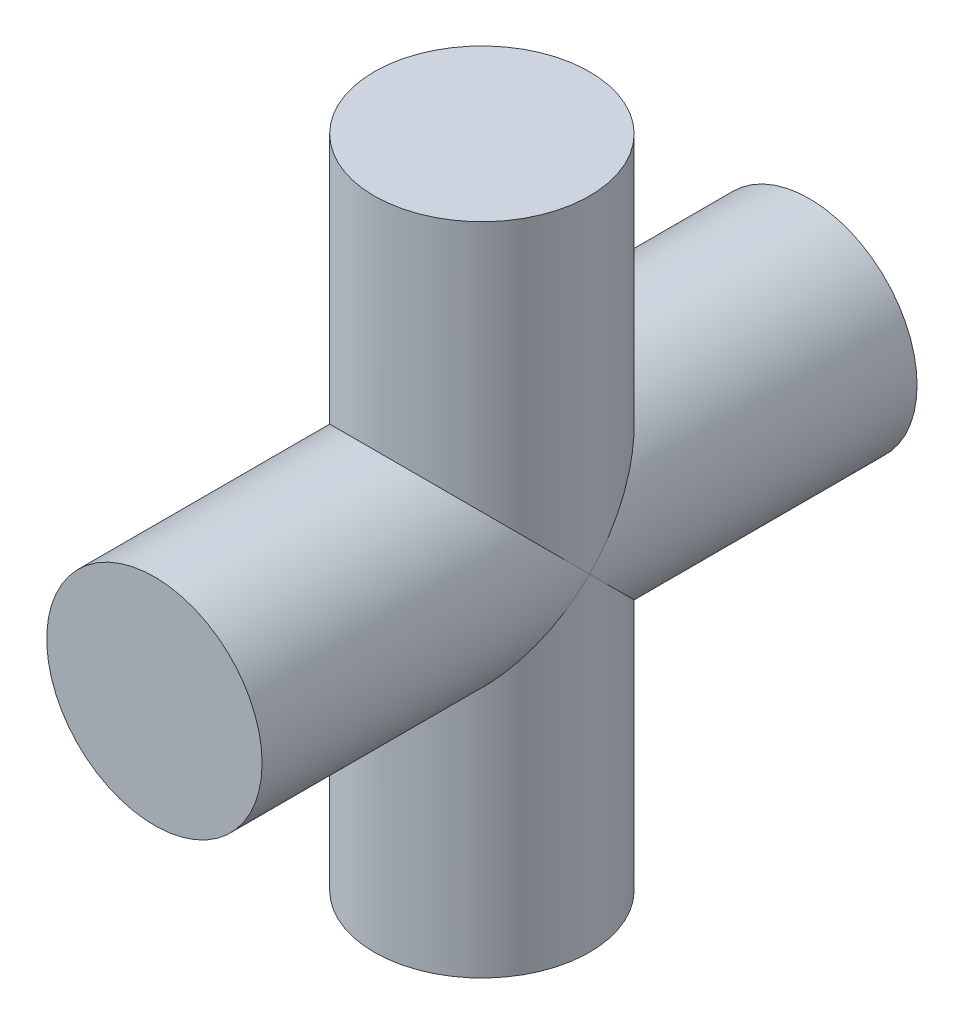
ISO-10303-21;
HEADER;
FILE_DESCRIPTION(('STEP AP214'),'2;1');
FILE_NAME('part.step','',(''),(''),'','','');
FILE_SCHEMA(('AUTOMOTIVE_DESIGN { 1 0 10303 214 1 1 1 1 }'));
ENDSEC;
DATA;
#1=APPLICATION_CONTEXT('core data for automotive mechanical design processes');
#2=APPLICATION_PROTOCOL_DEFINITION('international standard','automotive_design',2000,#1);
#3=PRODUCT_CONTEXT('',#1,'mechanical');
#4=PRODUCT('Part','Part','',(#3));
#5=PRODUCT_RELATED_PRODUCT_CATEGORY('part','',(#4));
#6=PRODUCT_DEFINITION_FORMATION('','',#4);
#7=PRODUCT_DEFINITION_CONTEXT('part definition',#1,'design');
#8=PRODUCT_DEFINITION('design','',#6,#7);
#9=PRODUCT_DEFINITION_SHAPE('','',#8);
#10=(LENGTH_UNIT() NAMED_UNIT(*) SI_UNIT(.MILLI.,.METRE.));
#11=(NAMED_UNIT(*) PLANE_ANGLE_UNIT() SI_UNIT($,.RADIAN.));
#12=(NAMED_UNIT(*) SI_UNIT($,.STERADIAN.) SOLID_ANGLE_UNIT());
#13=UNCERTAINTY_MEASURE_WITH_UNIT(LENGTH_MEASURE(1.E-05),#10,'distance_accuracy_value','');
#14=(GEOMETRIC_REPRESENTATION_CONTEXT(3) GLOBAL_UNCERTAINTY_ASSIGNED_CONTEXT((#13)) GLOBAL_UNIT_ASSIGNED_CONTEXT((#10,
#11,#12)) REPRESENTATION_CONTEXT('',''));
#15=CARTESIAN_POINT('',(0.,0.,0.));
#16=DIRECTION('',(0.,0.,1.));
#17=DIRECTION('',(1.,0.,0.));
#18=AXIS2_PLACEMENT_3D('',#15,#16,#17);
#19=CARTESIAN_POINT('',(0.,73.,0.));
#20=DIRECTION('',(0.,-1.,0.));
#21=DIRECTION('',(0.,0.,-1.));
#22=AXIS2_PLACEMENT_3D('',#19,#20,#21);
#23=CYLINDRICAL_SURFACE('',#22,12.);
#24=CARTESIAN_POINT('',(0.,36.5,0.));
#25=DIRECTION('',(0.,-0.707106781186547,-0.707106781186547));
#26=DIRECTION('',(0.,-0.707106781186547,0.707106781186547));
#27=AXIS2_PLACEMENT_3D('',#24,#25,#26);
#28=ELLIPSE('',#27,16.9705627484771,12.);
#29=CARTESIAN_POINT('',(12.,36.5,0.));
#30=VERTEX_POINT('',#29);
#31=CARTESIAN_POINT('',(-12.,36.5,0.));
#32=VERTEX_POINT('',#31);
#33=EDGE_CURVE('E61',#30,#32,#28,.T.);
#34=ORIENTED_EDGE('',*,*,#33,.T.);
#35=CARTESIAN_POINT('',(0.,36.5,0.));
#36=DIRECTION('',(0.,-0.707106781186547,0.707106781186547));
#37=DIRECTION('',(0.,-0.707106781186547,-0.707106781186547));
#38=AXIS2_PLACEMENT_3D('',#35,#36,#37);
#39=ELLIPSE('',#38,16.9705627484771,12.);
#40=EDGE_CURVE('E50',#32,#30,#39,.T.);
#41=ORIENTED_EDGE('',*,*,#40,.T.);
#42=EDGE_LOOP('',(#34,#41));
#43=FACE_BOUND('',#42,.T.);
#44=CARTESIAN_POINT('',(0.,0.,0.));
#45=DIRECTION('',(0.,1.,0.));
#46=DIRECTION('',(0.,0.,1.));
#47=AXIS2_PLACEMENT_3D('',#44,#45,#46);
#48=CIRCLE('',#47,12.);
#49=CARTESIAN_POINT('',(0.,0.,12.));
#50=VERTEX_POINT('',#49);
#51=EDGE_CURVE('E73',#50,#50,#48,.T.);
#52=ORIENTED_EDGE('',*,*,#51,.T.);
#53=EDGE_LOOP('',(#52));
#54=FACE_BOUND('',#53,.T.);
#55=ADVANCED_FACE('F43',(#43,#54),#23,.T.);
#56=CARTESIAN_POINT('',(0.,0.,0.));
#57=DIRECTION('',(0.,1.,0.));
#58=DIRECTION('',(0.,0.,1.));
#59=AXIS2_PLACEMENT_3D('',#56,#57,#58);
#60=PLANE('',#59);
#61=ORIENTED_EDGE('',*,*,#51,.F.);
#62=EDGE_LOOP('',(#61));
#63=FACE_BOUND('',#62,.T.);
#64=ADVANCED_FACE('F100',(#63),#60,.F.);
#65=CARTESIAN_POINT('',(0.,36.5,-36.5));
#66=DIRECTION('',(0.,0.,1.));
#67=DIRECTION('',(1.,0.,0.));
#68=AXIS2_PLACEMENT_3D('',#65,#66,#67);
#69=PLANE('',#68);
#70=CARTESIAN_POINT('',(0.,36.5,-36.5));
#71=DIRECTION('',(0.,0.,1.));
#72=DIRECTION('',(1.,0.,0.));
#73=AXIS2_PLACEMENT_3D('',#70,#71,#72);
#74=CIRCLE('',#73,12.);
#75=CARTESIAN_POINT('',(12.,36.5,-36.5));
#76=VERTEX_POINT('',#75);
#77=EDGE_CURVE('E76',#76,#76,#74,.T.);
#78=ORIENTED_EDGE('',*,*,#77,.F.);
#79=EDGE_LOOP('',(#78));
#80=FACE_BOUND('',#79,.T.);
#81=ADVANCED_FACE('F95',(#80),#69,.F.);
#82=CARTESIAN_POINT('',(0.,36.5,-36.5));
#83=DIRECTION('',(0.,0.,1.));
#84=DIRECTION('',(1.,0.,0.));
#85=AXIS2_PLACEMENT_3D('',#82,#83,#84);
#86=CYLINDRICAL_SURFACE('',#85,12.);
#87=ORIENTED_EDGE('',*,*,#77,.T.);
#88=EDGE_LOOP('',(#87));
#89=FACE_BOUND('',#88,.T.);
#90=ORIENTED_EDGE('',*,*,#40,.F.);
#91=CARTESIAN_POINT('',(0.,36.5,0.));
#92=DIRECTION('',(0.,-0.707106781186547,-0.707106781186547));
#93=DIRECTION('',(0.,-0.707106781186547,0.707106781186547));
#94=AXIS2_PLACEMENT_3D('',#91,#92,#93);
#95=ELLIPSE('',#94,16.9705627484771,12.);
#96=EDGE_CURVE('E55',#30,#32,#95,.F.);
#97=ORIENTED_EDGE('',*,*,#96,.F.);
#98=EDGE_LOOP('',(#90,#97));
#99=FACE_BOUND('',#98,.T.);
#100=ADVANCED_FACE('F67',(#89,#99),#86,.T.);
#101=CARTESIAN_POINT('',(0.,36.5,36.5));
#102=DIRECTION('',(0.,0.,1.));
#103=DIRECTION('',(1.,0.,0.));
#104=AXIS2_PLACEMENT_3D('',#101,#102,#103);
#105=CIRCLE('',#104,12.);
#106=CARTESIAN_POINT('',(12.,36.5,36.5));
#107=VERTEX_POINT('',#106);
#108=EDGE_CURVE('E81',#107,#107,#105,.T.);
#109=ORIENTED_EDGE('',*,*,#108,.F.);
#110=EDGE_LOOP('',(#109));
#111=FACE_BOUND('',#110,.T.);
#112=CARTESIAN_POINT('',(0.,36.5,0.));
#113=DIRECTION('',(0.,-0.707106781186547,0.707106781186547));
#114=DIRECTION('',(0.,-0.707106781186547,-0.707106781186547));
#115=AXIS2_PLACEMENT_3D('',#112,#113,#114);
#116=ELLIPSE('',#115,16.9705627484771,12.);
#117=EDGE_CURVE('E11',#32,#30,#116,.F.);
#118=ORIENTED_EDGE('',*,*,#117,.F.);
#119=ORIENTED_EDGE('',*,*,#33,.F.);
#120=EDGE_LOOP('',(#118,#119));
#121=FACE_BOUND('',#120,.T.);
#122=ADVANCED_FACE('F62',(#111,#121),#86,.T.);
#123=CARTESIAN_POINT('',(0.,36.5,36.5));
#124=DIRECTION('',(0.,0.,1.));
#125=DIRECTION('',(1.,0.,0.));
#126=AXIS2_PLACEMENT_3D('',#123,#124,#125);
#127=PLANE('',#126);
#128=ORIENTED_EDGE('',*,*,#108,.T.);
#129=EDGE_LOOP('',(#128));
#130=FACE_BOUND('',#129,.T.);
#131=ADVANCED_FACE('F85',(#130),#127,.T.);
#132=CARTESIAN_POINT('',(0.,73.,0.));
#133=DIRECTION('',(0.,1.,0.));
#134=DIRECTION('',(0.,0.,1.));
#135=AXIS2_PLACEMENT_3D('',#132,#133,#134);
#136=PLANE('',#135);
#137=CARTESIAN_POINT('',(0.,73.,0.));
#138=DIRECTION('',(0.,1.,0.));
#139=DIRECTION('',(0.,0.,1.));
#140=AXIS2_PLACEMENT_3D('',#137,#138,#139);
#141=CIRCLE('',#140,12.);
#142=CARTESIAN_POINT('',(0.,73.,12.));
#143=VERTEX_POINT('',#142);
#144=EDGE_CURVE('E68',#143,#143,#141,.T.);
#145=ORIENTED_EDGE('',*,*,#144,.T.);
#146=EDGE_LOOP('',(#145));
#147=FACE_BOUND('',#146,.T.);
#148=ADVANCED_FACE('F93',(#147),#136,.T.);
#149=ORIENTED_EDGE('',*,*,#144,.F.);
#150=EDGE_LOOP('',(#149));
#151=FACE_BOUND('',#150,.T.);
#152=ORIENTED_EDGE('',*,*,#96,.T.);
#153=ORIENTED_EDGE('',*,*,#117,.T.);
#154=EDGE_LOOP('',(#152,#153));
#155=FACE_BOUND('',#154,.T.);
#156=ADVANCED_FACE('F70',(#151,#155),#23,.T.);
#157=CLOSED_SHELL('',(#55,#64,#81,#100,#122,#131,#148,#156));
#158=MANIFOLD_SOLID_BREP('B2',#157);
#159=ADVANCED_BREP_SHAPE_REPRESENTATION('',(#18,#158),#14);
#160=SHAPE_DEFINITION_REPRESENTATION(#9,#159);
ENDSEC;
END-ISO-10303-21;
